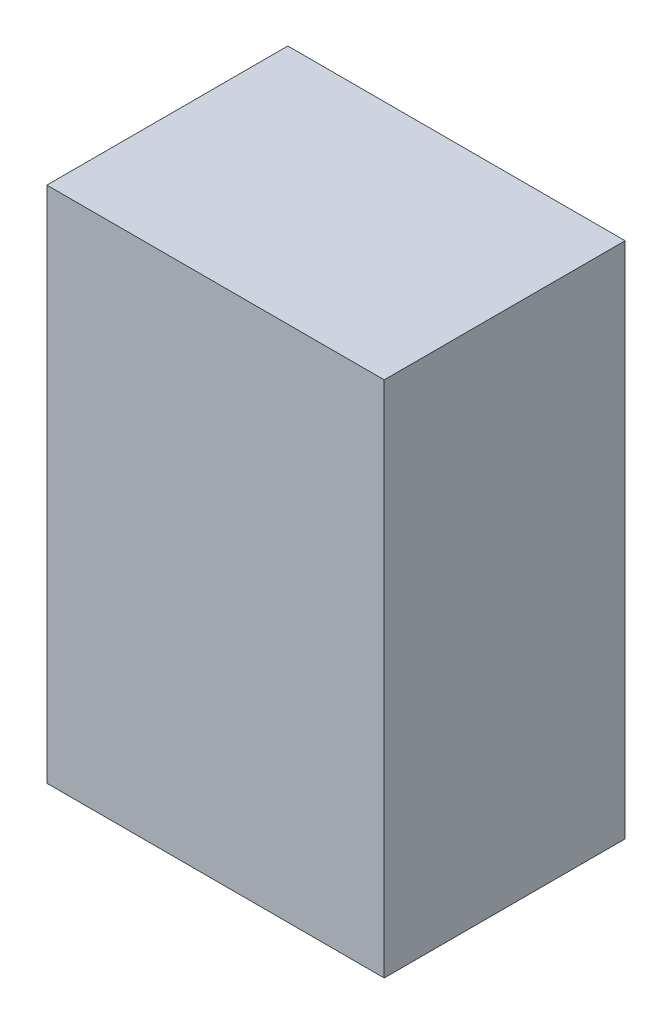
ISO-10303-21;
HEADER;
FILE_DESCRIPTION(('STEP AP214'),'2;1');
FILE_NAME('part.step','',(''),(''),'','','');
FILE_SCHEMA(('AUTOMOTIVE_DESIGN { 1 0 10303 214 1 1 1 1 }'));
ENDSEC;
DATA;
#1=APPLICATION_CONTEXT('core data for automotive mechanical design processes');
#2=APPLICATION_PROTOCOL_DEFINITION('international standard','automotive_design',2000,#1);
#3=PRODUCT_CONTEXT('',#1,'mechanical');
#4=PRODUCT('Part','Part','',(#3));
#5=PRODUCT_RELATED_PRODUCT_CATEGORY('part','',(#4));
#6=PRODUCT_DEFINITION_FORMATION('','',#4);
#7=PRODUCT_DEFINITION_CONTEXT('part definition',#1,'design');
#8=PRODUCT_DEFINITION('design','',#6,#7);
#9=PRODUCT_DEFINITION_SHAPE('','',#8);
#10=(LENGTH_UNIT() NAMED_UNIT(*) SI_UNIT(.MILLI.,.METRE.));
#11=(NAMED_UNIT(*) PLANE_ANGLE_UNIT() SI_UNIT($,.RADIAN.));
#12=(NAMED_UNIT(*) SI_UNIT($,.STERADIAN.) SOLID_ANGLE_UNIT());
#13=UNCERTAINTY_MEASURE_WITH_UNIT(LENGTH_MEASURE(1.E-05),#10,'distance_accuracy_value','');
#14=(GEOMETRIC_REPRESENTATION_CONTEXT(3) GLOBAL_UNCERTAINTY_ASSIGNED_CONTEXT((#13)) GLOBAL_UNIT_ASSIGNED_CONTEXT((#10,
#11,#12)) REPRESENTATION_CONTEXT('',''));
#15=CARTESIAN_POINT('',(0.,0.,0.));
#16=DIRECTION('',(0.,0.,1.));
#17=DIRECTION('',(1.,0.,0.));
#18=AXIS2_PLACEMENT_3D('',#15,#16,#17);
#19=CARTESIAN_POINT('',(-0.6999986,1.07500166,1.));
#20=DIRECTION('',(0.,0.,-1.));
#21=DIRECTION('',(-1.,0.,0.));
#22=AXIS2_PLACEMENT_3D('',#19,#20,#21);
#23=PLANE('',#22);
#24=DIRECTION('',(1.,0.,0.));
#25=VECTOR('',#24,1.);
#26=CARTESIAN_POINT('',(-0.6999986,-1.07499912,1.));
#27=LINE('',#26,#25);
#28=CARTESIAN_POINT('',(-0.6999986,-1.07499912,1.));
#29=VERTEX_POINT('',#28);
#30=CARTESIAN_POINT('',(0.70000114,-1.07499912,1.));
#31=VERTEX_POINT('',#30);
#32=EDGE_CURVE('E53',#29,#31,#27,.T.);
#33=ORIENTED_EDGE('',*,*,#32,.T.);
#34=DIRECTION('',(0.,1.,0.));
#35=VECTOR('',#34,1.);
#36=CARTESIAN_POINT('',(0.70000114,-1.07499912,1.));
#37=LINE('',#36,#35);
#38=CARTESIAN_POINT('',(0.70000114,1.07500166,1.));
#39=VERTEX_POINT('',#38);
#40=EDGE_CURVE('E55',#31,#39,#37,.T.);
#41=ORIENTED_EDGE('',*,*,#40,.T.);
#42=DIRECTION('',(1.,0.,0.));
#43=VECTOR('',#42,1.);
#44=CARTESIAN_POINT('',(0.70000114,1.07500166,1.));
#45=LINE('',#44,#43);
#46=CARTESIAN_POINT('',(-0.6999986,1.07500166,1.));
#47=VERTEX_POINT('',#46);
#48=EDGE_CURVE('E18',#39,#47,#45,.F.);
#49=ORIENTED_EDGE('',*,*,#48,.T.);
#50=DIRECTION('',(0.,1.,0.));
#51=VECTOR('',#50,1.);
#52=CARTESIAN_POINT('',(-0.6999986,1.07500166,1.));
#53=LINE('',#52,#51);
#54=EDGE_CURVE('E78',#47,#29,#53,.F.);
#55=ORIENTED_EDGE('',*,*,#54,.T.);
#56=EDGE_LOOP('',(#33,#41,#49,#55));
#57=FACE_BOUND('',#56,.T.);
#58=ADVANCED_FACE('F15',(#57),#23,.F.);
#59=CARTESIAN_POINT('',(0.70000114,1.07500166,0.));
#60=DIRECTION('',(0.,-1.,0.));
#61=DIRECTION('',(0.,0.,-1.));
#62=AXIS2_PLACEMENT_3D('',#59,#60,#61);
#63=PLANE('',#62);
#64=DIRECTION('',(0.,0.,-1.));
#65=VECTOR('',#64,1.);
#66=CARTESIAN_POINT('',(-0.6999986,1.07500166,0.));
#67=LINE('',#66,#65);
#68=CARTESIAN_POINT('',(-0.6999986,1.07500166,0.));
#69=VERTEX_POINT('',#68);
#70=EDGE_CURVE('E66',#69,#47,#67,.F.);
#71=ORIENTED_EDGE('',*,*,#70,.T.);
#72=ORIENTED_EDGE('',*,*,#48,.F.);
#73=DIRECTION('',(0.,0.,1.));
#74=VECTOR('',#73,1.);
#75=CARTESIAN_POINT('',(0.70000114,1.07500166,0.));
#76=LINE('',#75,#74);
#77=CARTESIAN_POINT('',(0.70000114,1.07500166,0.));
#78=VERTEX_POINT('',#77);
#79=EDGE_CURVE('E61',#39,#78,#76,.F.);
#80=ORIENTED_EDGE('',*,*,#79,.T.);
#81=DIRECTION('',(-1.,0.,0.));
#82=VECTOR('',#81,1.);
#83=CARTESIAN_POINT('',(-0.6999986,1.07500166,0.));
#84=LINE('',#83,#82);
#85=EDGE_CURVE('E81',#69,#78,#84,.F.);
#86=ORIENTED_EDGE('',*,*,#85,.F.);
#87=EDGE_LOOP('',(#71,#72,#80,#86));
#88=FACE_BOUND('',#87,.T.);
#89=ADVANCED_FACE('F63',(#88),#63,.F.);
#90=CARTESIAN_POINT('',(0.70000114,-1.07499912,0.));
#91=DIRECTION('',(-1.,0.,0.));
#92=DIRECTION('',(0.,0.,1.));
#93=AXIS2_PLACEMENT_3D('',#90,#91,#92);
#94=PLANE('',#93);
#95=ORIENTED_EDGE('',*,*,#79,.F.);
#96=ORIENTED_EDGE('',*,*,#40,.F.);
#97=DIRECTION('',(0.,0.,1.));
#98=VECTOR('',#97,1.);
#99=CARTESIAN_POINT('',(0.70000114,-1.07499912,0.));
#100=LINE('',#99,#98);
#101=CARTESIAN_POINT('',(0.70000114,-1.07499912,0.));
#102=VERTEX_POINT('',#101);
#103=EDGE_CURVE('E73',#31,#102,#100,.F.);
#104=ORIENTED_EDGE('',*,*,#103,.T.);
#105=DIRECTION('',(0.,1.,0.));
#106=VECTOR('',#105,1.);
#107=CARTESIAN_POINT('',(0.70000114,1.07500166,0.));
#108=LINE('',#107,#106);
#109=EDGE_CURVE('E70',#78,#102,#108,.F.);
#110=ORIENTED_EDGE('',*,*,#109,.F.);
#111=EDGE_LOOP('',(#95,#96,#104,#110));
#112=FACE_BOUND('',#111,.T.);
#113=ADVANCED_FACE('F68',(#112),#94,.F.);
#114=CARTESIAN_POINT('',(-0.6999986,-1.07499912,0.));
#115=DIRECTION('',(0.,1.,0.));
#116=DIRECTION('',(0.,0.,1.));
#117=AXIS2_PLACEMENT_3D('',#114,#115,#116);
#118=PLANE('',#117);
#119=ORIENTED_EDGE('',*,*,#103,.F.);
#120=ORIENTED_EDGE('',*,*,#32,.F.);
#121=DIRECTION('',(0.,0.,-1.));
#122=VECTOR('',#121,1.);
#123=CARTESIAN_POINT('',(-0.6999986,-1.07499912,0.));
#124=LINE('',#123,#122);
#125=CARTESIAN_POINT('',(-0.6999986,-1.07499912,0.));
#126=VERTEX_POINT('',#125);
#127=EDGE_CURVE('E33',#29,#126,#124,.T.);
#128=ORIENTED_EDGE('',*,*,#127,.T.);
#129=DIRECTION('',(-1.,0.,0.));
#130=VECTOR('',#129,1.);
#131=CARTESIAN_POINT('',(-0.6999986,-1.07499912,0.));
#132=LINE('',#131,#130);
#133=EDGE_CURVE('E24',#102,#126,#132,.T.);
#134=ORIENTED_EDGE('',*,*,#133,.F.);
#135=EDGE_LOOP('',(#119,#120,#128,#134));
#136=FACE_BOUND('',#135,.T.);
#137=ADVANCED_FACE('F87',(#136),#118,.F.);
#138=CARTESIAN_POINT('',(-0.6999986,1.07500166,0.));
#139=DIRECTION('',(1.,0.,0.));
#140=DIRECTION('',(0.,0.,-1.));
#141=AXIS2_PLACEMENT_3D('',#138,#139,#140);
#142=PLANE('',#141);
#143=ORIENTED_EDGE('',*,*,#127,.F.);
#144=ORIENTED_EDGE('',*,*,#54,.F.);
#145=ORIENTED_EDGE('',*,*,#70,.F.);
#146=DIRECTION('',(0.,1.,0.));
#147=VECTOR('',#146,1.);
#148=CARTESIAN_POINT('',(-0.6999986,1.07500166,0.));
#149=LINE('',#148,#147);
#150=EDGE_CURVE('E10',#126,#69,#149,.T.);
#151=ORIENTED_EDGE('',*,*,#150,.F.);
#152=EDGE_LOOP('',(#143,#144,#145,#151));
#153=FACE_BOUND('',#152,.T.);
#154=ADVANCED_FACE('F89',(#153),#142,.F.);
#155=CARTESIAN_POINT('',(-0.6999986,1.07500166,0.));
#156=DIRECTION('',(0.,0.,-1.));
#157=DIRECTION('',(-1.,0.,0.));
#158=AXIS2_PLACEMENT_3D('',#155,#156,#157);
#159=PLANE('',#158);
#160=ORIENTED_EDGE('',*,*,#133,.T.);
#161=ORIENTED_EDGE('',*,*,#150,.T.);
#162=ORIENTED_EDGE('',*,*,#85,.T.);
#163=ORIENTED_EDGE('',*,*,#109,.T.);
#164=EDGE_LOOP('',(#160,#161,#162,#163));
#165=FACE_BOUND('',#164,.T.);
#166=ADVANCED_FACE('F86',(#165),#159,.T.);
#167=CLOSED_SHELL('',(#58,#89,#113,#137,#154,#166));
#168=MANIFOLD_SOLID_BREP('B1',#167);
#169=ADVANCED_BREP_SHAPE_REPRESENTATION('',(#18,#168),#14);
#170=SHAPE_DEFINITION_REPRESENTATION(#9,#169);
ENDSEC;
END-ISO-10303-21;
